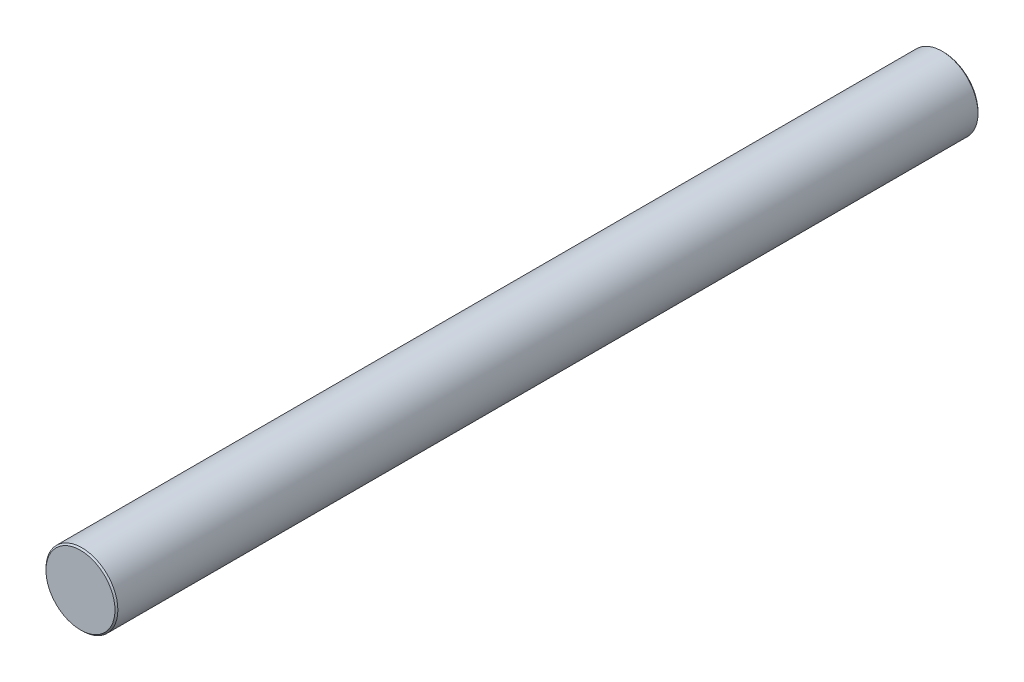
ISO-10303-21;
HEADER;
FILE_DESCRIPTION(('STEP AP214'),'2;1');
FILE_NAME('part.step','',(''),(''),'','','');
FILE_SCHEMA(('AUTOMOTIVE_DESIGN { 1 0 10303 214 1 1 1 1 }'));
ENDSEC;
DATA;
#1=APPLICATION_CONTEXT('core data for automotive mechanical design processes');
#2=APPLICATION_PROTOCOL_DEFINITION('international standard','automotive_design',2000,#1);
#3=PRODUCT_CONTEXT('',#1,'mechanical');
#4=PRODUCT('Part','Part','',(#3));
#5=PRODUCT_RELATED_PRODUCT_CATEGORY('part','',(#4));
#6=PRODUCT_DEFINITION_FORMATION('','',#4);
#7=PRODUCT_DEFINITION_CONTEXT('part definition',#1,'design');
#8=PRODUCT_DEFINITION('design','',#6,#7);
#9=PRODUCT_DEFINITION_SHAPE('','',#8);
#10=(LENGTH_UNIT() NAMED_UNIT(*) SI_UNIT(.MILLI.,.METRE.));
#11=(NAMED_UNIT(*) PLANE_ANGLE_UNIT() SI_UNIT($,.RADIAN.));
#12=(NAMED_UNIT(*) SI_UNIT($,.STERADIAN.) SOLID_ANGLE_UNIT());
#13=UNCERTAINTY_MEASURE_WITH_UNIT(LENGTH_MEASURE(1.E-05),#10,'distance_accuracy_value','');
#14=(GEOMETRIC_REPRESENTATION_CONTEXT(3) GLOBAL_UNCERTAINTY_ASSIGNED_CONTEXT((#13)) GLOBAL_UNIT_ASSIGNED_CONTEXT((#10,
#11,#12)) REPRESENTATION_CONTEXT('',''));
#15=CARTESIAN_POINT('',(0.,0.,0.));
#16=DIRECTION('',(0.,0.,1.));
#17=DIRECTION('',(1.,0.,0.));
#18=AXIS2_PLACEMENT_3D('',#15,#16,#17);
#19=CARTESIAN_POINT('',(0.,0.,152.4));
#20=DIRECTION('',(0.,0.,-1.));
#21=DIRECTION('',(-1.,0.,0.));
#22=AXIS2_PLACEMENT_3D('',#19,#20,#21);
#23=CYLINDRICAL_SURFACE('',#22,12.7);
#24=CARTESIAN_POINT('',(0.,0.,-151.892));
#25=DIRECTION('',(0.,0.,1.));
#26=DIRECTION('',(1.,0.,0.));
#27=AXIS2_PLACEMENT_3D('',#24,#25,#26);
#28=CIRCLE('',#27,12.7);
#29=CARTESIAN_POINT('',(12.7,0.,-151.892));
#30=VERTEX_POINT('',#29);
#31=EDGE_CURVE('E41',#30,#30,#28,.T.);
#32=ORIENTED_EDGE('',*,*,#31,.T.);
#33=EDGE_LOOP('',(#32));
#34=FACE_BOUND('',#33,.T.);
#35=CARTESIAN_POINT('',(0.,0.,151.892));
#36=DIRECTION('',(0.,0.,1.));
#37=DIRECTION('',(1.,0.,0.));
#38=AXIS2_PLACEMENT_3D('',#35,#36,#37);
#39=CIRCLE('',#38,12.7);
#40=CARTESIAN_POINT('',(12.7,0.,151.892));
#41=VERTEX_POINT('',#40);
#42=EDGE_CURVE('E45',#41,#41,#39,.F.);
#43=ORIENTED_EDGE('',*,*,#42,.T.);
#44=EDGE_LOOP('',(#43));
#45=FACE_BOUND('',#44,.T.);
#46=ADVANCED_FACE('F30',(#34,#45),#23,.T.);
#47=CARTESIAN_POINT('',(0.,0.,152.4));
#48=DIRECTION('',(0.,0.,1.));
#49=DIRECTION('',(1.,0.,0.));
#50=AXIS2_PLACEMENT_3D('',#47,#48,#49);
#51=PLANE('',#50);
#52=CARTESIAN_POINT('',(0.,0.,152.4));
#53=DIRECTION('',(0.,0.,1.));
#54=DIRECTION('',(1.,0.,0.));
#55=AXIS2_PLACEMENT_3D('',#52,#53,#54);
#56=CIRCLE('',#55,12.1920000000001);
#57=CARTESIAN_POINT('',(12.1920000000001,0.,152.4));
#58=VERTEX_POINT('',#57);
#59=EDGE_CURVE('E10',#58,#58,#56,.T.);
#60=ORIENTED_EDGE('',*,*,#59,.T.);
#61=EDGE_LOOP('',(#60));
#62=FACE_BOUND('',#61,.T.);
#63=ADVANCED_FACE('F61',(#62),#51,.T.);
#64=CARTESIAN_POINT('',(0.,0.,-152.4));
#65=DIRECTION('',(0.,0.,1.));
#66=DIRECTION('',(1.,0.,0.));
#67=AXIS2_PLACEMENT_3D('',#64,#65,#66);
#68=PLANE('',#67);
#69=CARTESIAN_POINT('',(0.,0.,-152.4));
#70=DIRECTION('',(0.,0.,1.));
#71=DIRECTION('',(1.,0.,0.));
#72=AXIS2_PLACEMENT_3D('',#69,#70,#71);
#73=CIRCLE('',#72,12.1919999999999);
#74=CARTESIAN_POINT('',(12.1919999999999,0.,-152.4));
#75=VERTEX_POINT('',#74);
#76=EDGE_CURVE('E37',#75,#75,#73,.F.);
#77=ORIENTED_EDGE('',*,*,#76,.T.);
#78=EDGE_LOOP('',(#77));
#79=FACE_BOUND('',#78,.T.);
#80=ADVANCED_FACE('F58',(#79),#68,.F.);
#81=CARTESIAN_POINT('',(0.,0.,-151.892));
#82=DIRECTION('',(0.,0.,1.));
#83=DIRECTION('',(1.,0.,0.));
#84=AXIS2_PLACEMENT_3D('',#81,#82,#83);
#85=CONICAL_SURFACE('',#84,12.7,0.78539816339746);
#86=ORIENTED_EDGE('',*,*,#76,.F.);
#87=EDGE_LOOP('',(#86));
#88=FACE_BOUND('',#87,.T.);
#89=ORIENTED_EDGE('',*,*,#31,.F.);
#90=EDGE_LOOP('',(#89));
#91=FACE_BOUND('',#90,.T.);
#92=ADVANCED_FACE('F54',(#88,#91),#85,.T.);
#93=CARTESIAN_POINT('',(0.,0.,152.4));
#94=DIRECTION('',(0.,0.,-1.));
#95=DIRECTION('',(-1.,0.,0.));
#96=AXIS2_PLACEMENT_3D('',#93,#94,#95);
#97=CONICAL_SURFACE('',#96,12.1920000000001,0.785398163397433);
#98=ORIENTED_EDGE('',*,*,#42,.F.);
#99=EDGE_LOOP('',(#98));
#100=FACE_BOUND('',#99,.T.);
#101=ORIENTED_EDGE('',*,*,#59,.F.);
#102=EDGE_LOOP('',(#101));
#103=FACE_BOUND('',#102,.T.);
#104=ADVANCED_FACE('F32',(#100,#103),#97,.T.);
#105=CLOSED_SHELL('',(#46,#63,#80,#92,#104));
#106=MANIFOLD_SOLID_BREP('B2',#105);
#107=ADVANCED_BREP_SHAPE_REPRESENTATION('',(#18,#106),#14);
#108=SHAPE_DEFINITION_REPRESENTATION(#9,#107);
ENDSEC;
END-ISO-10303-21;
